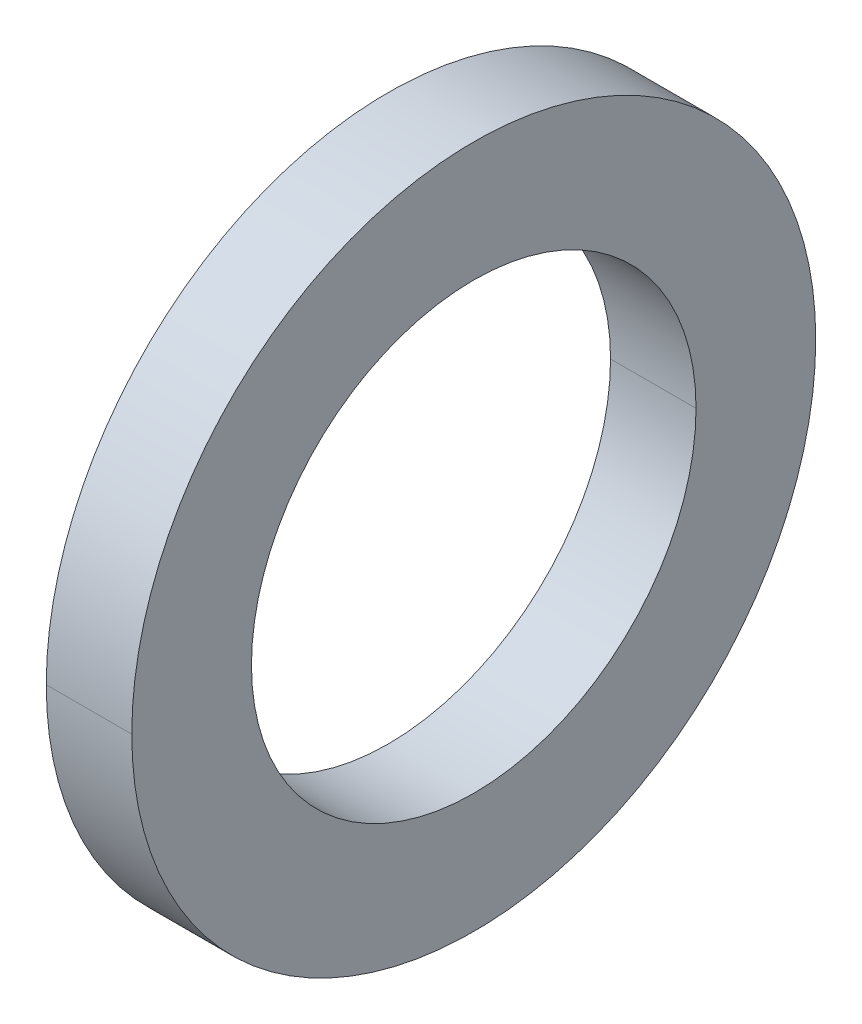
ISO-10303-21;
HEADER;
FILE_DESCRIPTION(('STEP AP214'),'2;1');
FILE_NAME('part.step','',(''),(''),'','','');
FILE_SCHEMA(('AUTOMOTIVE_DESIGN { 1 0 10303 214 1 1 1 1 }'));
ENDSEC;
DATA;
#1=APPLICATION_CONTEXT('core data for automotive mechanical design processes');
#2=APPLICATION_PROTOCOL_DEFINITION('international standard','automotive_design',2000,#1);
#3=PRODUCT_CONTEXT('',#1,'mechanical');
#4=PRODUCT('Part','Part','',(#3));
#5=PRODUCT_RELATED_PRODUCT_CATEGORY('part','',(#4));
#6=PRODUCT_DEFINITION_FORMATION('','',#4);
#7=PRODUCT_DEFINITION_CONTEXT('part definition',#1,'design');
#8=PRODUCT_DEFINITION('design','',#6,#7);
#9=PRODUCT_DEFINITION_SHAPE('','',#8);
#10=(LENGTH_UNIT() NAMED_UNIT(*) SI_UNIT(.MILLI.,.METRE.));
#11=(NAMED_UNIT(*) PLANE_ANGLE_UNIT() SI_UNIT($,.RADIAN.));
#12=(NAMED_UNIT(*) SI_UNIT($,.STERADIAN.) SOLID_ANGLE_UNIT());
#13=UNCERTAINTY_MEASURE_WITH_UNIT(LENGTH_MEASURE(1.E-05),#10,'distance_accuracy_value','');
#14=(GEOMETRIC_REPRESENTATION_CONTEXT(3) GLOBAL_UNCERTAINTY_ASSIGNED_CONTEXT((#13)) GLOBAL_UNIT_ASSIGNED_CONTEXT((#10,
#11,#12)) REPRESENTATION_CONTEXT('',''));
#15=CARTESIAN_POINT('',(0.,0.,0.));
#16=DIRECTION('',(0.,0.,1.));
#17=DIRECTION('',(1.,0.,0.));
#18=AXIS2_PLACEMENT_3D('',#15,#16,#17);
#19=CARTESIAN_POINT('',(-0.5,0.,0.));
#20=DIRECTION('',(1.,0.,0.));
#21=DIRECTION('',(0.,1.,0.));
#22=AXIS2_PLACEMENT_3D('',#19,#20,#21);
#23=PLANE('',#22);
#24=CARTESIAN_POINT('',(-0.5,0.,0.));
#25=DIRECTION('',(1.,0.,0.));
#26=DIRECTION('',(0.,0.,1.));
#27=AXIS2_PLACEMENT_3D('',#24,#25,#26);
#28=CIRCLE('',#27,2.6);
#29=CARTESIAN_POINT('',(-0.5,0.,2.6));
#30=VERTEX_POINT('',#29);
#31=CARTESIAN_POINT('',(-0.5,0.,-2.6));
#32=VERTEX_POINT('',#31);
#33=EDGE_CURVE('E106',#30,#32,#28,.T.);
#34=ORIENTED_EDGE('',*,*,#33,.T.);
#35=CARTESIAN_POINT('',(-0.5,0.,0.));
#36=DIRECTION('',(1.,0.,0.));
#37=DIRECTION('',(0.,0.,1.));
#38=AXIS2_PLACEMENT_3D('',#35,#36,#37);
#39=CIRCLE('',#38,2.6);
#40=EDGE_CURVE('E11',#32,#30,#39,.T.);
#41=ORIENTED_EDGE('',*,*,#40,.T.);
#42=EDGE_LOOP('',(#34,#41));
#43=FACE_BOUND('',#42,.T.);
#44=CARTESIAN_POINT('',(-0.5,0.,0.));
#45=DIRECTION('',(1.,0.,0.));
#46=DIRECTION('',(0.,0.,1.));
#47=AXIS2_PLACEMENT_3D('',#44,#45,#46);
#48=CIRCLE('',#47,4.);
#49=CARTESIAN_POINT('',(-0.5,0.,4.));
#50=VERTEX_POINT('',#49);
#51=CARTESIAN_POINT('',(-0.5,0.,-4.));
#52=VERTEX_POINT('',#51);
#53=EDGE_CURVE('E27',#50,#52,#48,.T.);
#54=ORIENTED_EDGE('',*,*,#53,.F.);
#55=CARTESIAN_POINT('',(-0.5,0.,0.));
#56=DIRECTION('',(1.,0.,0.));
#57=DIRECTION('',(0.,0.,1.));
#58=AXIS2_PLACEMENT_3D('',#55,#56,#57);
#59=CIRCLE('',#58,4.);
#60=EDGE_CURVE('E92',#52,#50,#59,.T.);
#61=ORIENTED_EDGE('',*,*,#60,.F.);
#62=EDGE_LOOP('',(#54,#61));
#63=FACE_BOUND('',#62,.T.);
#64=ADVANCED_FACE('F17',(#43,#63),#23,.F.);
#65=CARTESIAN_POINT('',(0.5,0.,0.));
#66=DIRECTION('',(-1.,0.,0.));
#67=DIRECTION('',(0.,0.,1.));
#68=AXIS2_PLACEMENT_3D('',#65,#66,#67);
#69=CYLINDRICAL_SURFACE('',#68,2.6);
#70=DIRECTION('',(-1.,0.,0.));
#71=VECTOR('',#70,1.);
#72=CARTESIAN_POINT('',(0.5,0.,-2.6));
#73=LINE('',#72,#71);
#74=CARTESIAN_POINT('',(0.5,0.,-2.6));
#75=VERTEX_POINT('',#74);
#76=EDGE_CURVE('E103',#75,#32,#73,.T.);
#77=ORIENTED_EDGE('',*,*,#76,.F.);
#78=CARTESIAN_POINT('',(0.5,0.,0.));
#79=DIRECTION('',(-1.,0.,0.));
#80=DIRECTION('',(0.,0.,1.));
#81=AXIS2_PLACEMENT_3D('',#78,#79,#80);
#82=CIRCLE('',#81,2.6);
#83=CARTESIAN_POINT('',(0.5,0.,2.6));
#84=VERTEX_POINT('',#83);
#85=EDGE_CURVE('E84',#84,#75,#82,.T.);
#86=ORIENTED_EDGE('',*,*,#85,.F.);
#87=DIRECTION('',(-1.,0.,0.));
#88=VECTOR('',#87,1.);
#89=CARTESIAN_POINT('',(0.5,0.,2.6));
#90=LINE('',#89,#88);
#91=EDGE_CURVE('E20',#84,#30,#90,.T.);
#92=ORIENTED_EDGE('',*,*,#91,.T.);
#93=ORIENTED_EDGE('',*,*,#40,.F.);
#94=EDGE_LOOP('',(#77,#86,#92,#93));
#95=FACE_BOUND('',#94,.T.);
#96=ADVANCED_FACE('F127',(#95),#69,.F.);
#97=CARTESIAN_POINT('',(0.5,0.,0.));
#98=DIRECTION('',(-1.,0.,0.));
#99=DIRECTION('',(0.,0.,1.));
#100=AXIS2_PLACEMENT_3D('',#97,#98,#99);
#101=CYLINDRICAL_SURFACE('',#100,4.);
#102=DIRECTION('',(-1.,0.,0.));
#103=VECTOR('',#102,1.);
#104=CARTESIAN_POINT('',(0.5,0.,-4.));
#105=LINE('',#104,#103);
#106=CARTESIAN_POINT('',(0.5,0.,-4.));
#107=VERTEX_POINT('',#106);
#108=EDGE_CURVE('E87',#107,#52,#105,.T.);
#109=ORIENTED_EDGE('',*,*,#108,.F.);
#110=CARTESIAN_POINT('',(0.5,0.,0.));
#111=DIRECTION('',(1.,0.,0.));
#112=DIRECTION('',(0.,0.,1.));
#113=AXIS2_PLACEMENT_3D('',#110,#111,#112);
#114=CIRCLE('',#113,4.);
#115=CARTESIAN_POINT('',(0.5,0.,4.));
#116=VERTEX_POINT('',#115);
#117=EDGE_CURVE('E72',#116,#107,#114,.T.);
#118=ORIENTED_EDGE('',*,*,#117,.F.);
#119=DIRECTION('',(-1.,0.,0.));
#120=VECTOR('',#119,1.);
#121=CARTESIAN_POINT('',(0.5,0.,4.));
#122=LINE('',#121,#120);
#123=EDGE_CURVE('E95',#116,#50,#122,.T.);
#124=ORIENTED_EDGE('',*,*,#123,.T.);
#125=ORIENTED_EDGE('',*,*,#53,.T.);
#126=EDGE_LOOP('',(#109,#118,#124,#125));
#127=FACE_BOUND('',#126,.T.);
#128=ADVANCED_FACE('F88',(#127),#101,.T.);
#129=CARTESIAN_POINT('',(0.5,0.,0.));
#130=DIRECTION('',(1.,0.,0.));
#131=DIRECTION('',(0.,1.,0.));
#132=AXIS2_PLACEMENT_3D('',#129,#130,#131);
#133=PLANE('',#132);
#134=ORIENTED_EDGE('',*,*,#85,.T.);
#135=CARTESIAN_POINT('',(0.5,0.,0.));
#136=DIRECTION('',(-1.,0.,0.));
#137=DIRECTION('',(0.,0.,1.));
#138=AXIS2_PLACEMENT_3D('',#135,#136,#137);
#139=CIRCLE('',#138,2.6);
#140=EDGE_CURVE('E107',#75,#84,#139,.T.);
#141=ORIENTED_EDGE('',*,*,#140,.T.);
#142=EDGE_LOOP('',(#134,#141));
#143=FACE_BOUND('',#142,.T.);
#144=ORIENTED_EDGE('',*,*,#117,.T.);
#145=CARTESIAN_POINT('',(0.5,0.,0.));
#146=DIRECTION('',(1.,0.,0.));
#147=DIRECTION('',(0.,0.,1.));
#148=AXIS2_PLACEMENT_3D('',#145,#146,#147);
#149=CIRCLE('',#148,4.);
#150=EDGE_CURVE('E82',#107,#116,#149,.T.);
#151=ORIENTED_EDGE('',*,*,#150,.T.);
#152=EDGE_LOOP('',(#144,#151));
#153=FACE_BOUND('',#152,.T.);
#154=ADVANCED_FACE('F80',(#143,#153),#133,.T.);
#155=CARTESIAN_POINT('',(0.5,0.,0.));
#156=DIRECTION('',(-1.,0.,0.));
#157=DIRECTION('',(0.,0.,1.));
#158=AXIS2_PLACEMENT_3D('',#155,#156,#157);
#159=CYLINDRICAL_SURFACE('',#158,2.6);
#160=ORIENTED_EDGE('',*,*,#140,.F.);
#161=ORIENTED_EDGE('',*,*,#76,.T.);
#162=ORIENTED_EDGE('',*,*,#33,.F.);
#163=ORIENTED_EDGE('',*,*,#91,.F.);
#164=EDGE_LOOP('',(#160,#161,#162,#163));
#165=FACE_BOUND('',#164,.T.);
#166=ADVANCED_FACE('F130',(#165),#159,.F.);
#167=CARTESIAN_POINT('',(0.5,0.,0.));
#168=DIRECTION('',(-1.,0.,0.));
#169=DIRECTION('',(0.,0.,1.));
#170=AXIS2_PLACEMENT_3D('',#167,#168,#169);
#171=CYLINDRICAL_SURFACE('',#170,4.);
#172=ORIENTED_EDGE('',*,*,#150,.F.);
#173=ORIENTED_EDGE('',*,*,#108,.T.);
#174=ORIENTED_EDGE('',*,*,#60,.T.);
#175=ORIENTED_EDGE('',*,*,#123,.F.);
#176=EDGE_LOOP('',(#172,#173,#174,#175));
#177=FACE_BOUND('',#176,.T.);
#178=ADVANCED_FACE('F94',(#177),#171,.T.);
#179=CLOSED_SHELL('',(#64,#96,#128,#154,#166,#178));
#180=MANIFOLD_SOLID_BREP('B1',#179);
#181=ADVANCED_BREP_SHAPE_REPRESENTATION('',(#18,#180),#14);
#182=SHAPE_DEFINITION_REPRESENTATION(#9,#181);
ENDSEC;
END-ISO-10303-21;
